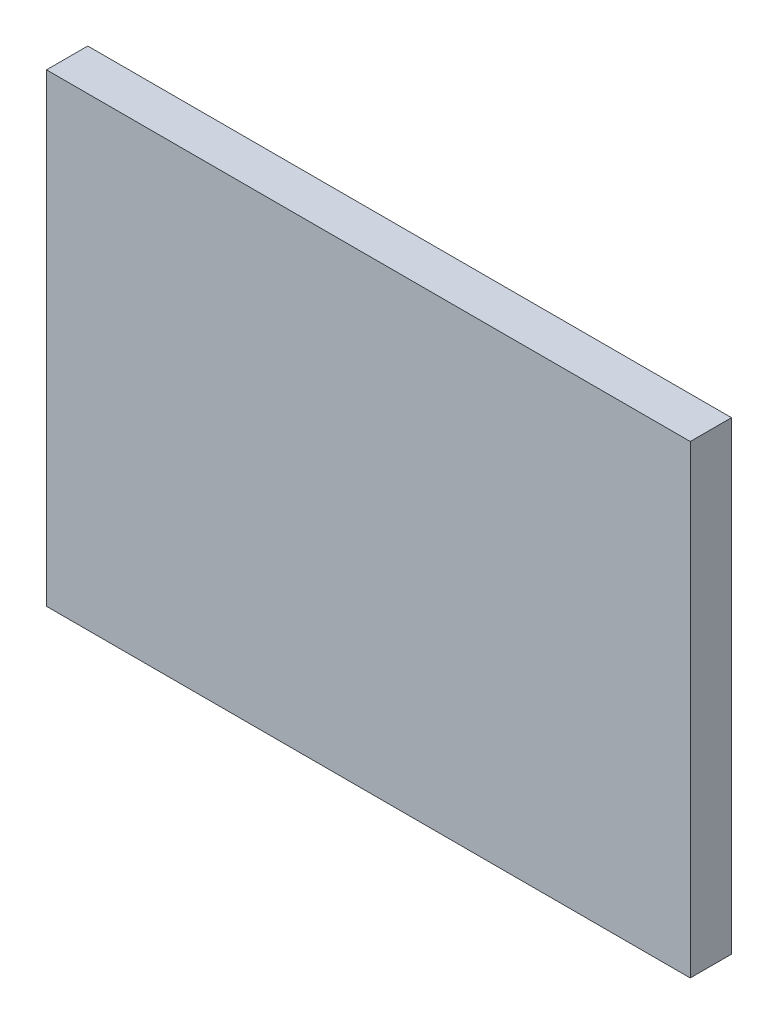
ISO-10303-21;
HEADER;
FILE_DESCRIPTION(('STEP AP214'),'2;1');
FILE_NAME('part.step','',(''),(''),'','','');
FILE_SCHEMA(('AUTOMOTIVE_DESIGN { 1 0 10303 214 1 1 1 1 }'));
ENDSEC;
DATA;
#1=APPLICATION_CONTEXT('core data for automotive mechanical design processes');
#2=APPLICATION_PROTOCOL_DEFINITION('international standard','automotive_design',2000,#1);
#3=PRODUCT_CONTEXT('',#1,'mechanical');
#4=PRODUCT('Part','Part','',(#3));
#5=PRODUCT_RELATED_PRODUCT_CATEGORY('part','',(#4));
#6=PRODUCT_DEFINITION_FORMATION('','',#4);
#7=PRODUCT_DEFINITION_CONTEXT('part definition',#1,'design');
#8=PRODUCT_DEFINITION('design','',#6,#7);
#9=PRODUCT_DEFINITION_SHAPE('','',#8);
#10=(LENGTH_UNIT() NAMED_UNIT(*) SI_UNIT(.MILLI.,.METRE.));
#11=(NAMED_UNIT(*) PLANE_ANGLE_UNIT() SI_UNIT($,.RADIAN.));
#12=(NAMED_UNIT(*) SI_UNIT($,.STERADIAN.) SOLID_ANGLE_UNIT());
#13=UNCERTAINTY_MEASURE_WITH_UNIT(LENGTH_MEASURE(1.E-05),#10,'distance_accuracy_value','');
#14=(GEOMETRIC_REPRESENTATION_CONTEXT(3) GLOBAL_UNCERTAINTY_ASSIGNED_CONTEXT((#13)) GLOBAL_UNIT_ASSIGNED_CONTEXT((#10,
#11,#12)) REPRESENTATION_CONTEXT('',''));
#15=CARTESIAN_POINT('',(0.,0.,0.));
#16=DIRECTION('',(0.,0.,1.));
#17=DIRECTION('',(1.,0.,0.));
#18=AXIS2_PLACEMENT_3D('',#15,#16,#17);
#19=CARTESIAN_POINT('',(29.65,21.4,3.8));
#20=DIRECTION('',(-1.,0.,0.));
#21=DIRECTION('',(0.,-1.,0.));
#22=AXIS2_PLACEMENT_3D('',#19,#20,#21);
#23=PLANE('',#22);
#24=DIRECTION('',(0.,1.,0.));
#25=VECTOR('',#24,1.);
#26=CARTESIAN_POINT('',(29.65,21.4,0.));
#27=LINE('',#26,#25);
#28=CARTESIAN_POINT('',(29.65,-21.4,0.));
#29=VERTEX_POINT('',#28);
#30=CARTESIAN_POINT('',(29.65,21.4,0.));
#31=VERTEX_POINT('',#30);
#32=EDGE_CURVE('E96',#29,#31,#27,.T.);
#33=ORIENTED_EDGE('',*,*,#32,.T.);
#34=DIRECTION('',(0.,0.,-1.));
#35=VECTOR('',#34,1.);
#36=CARTESIAN_POINT('',(29.65,21.4,3.8));
#37=LINE('',#36,#35);
#38=CARTESIAN_POINT('',(29.65,21.4,3.8));
#39=VERTEX_POINT('',#38);
#40=EDGE_CURVE('E11',#39,#31,#37,.T.);
#41=ORIENTED_EDGE('',*,*,#40,.F.);
#42=DIRECTION('',(0.,1.,0.));
#43=VECTOR('',#42,1.);
#44=CARTESIAN_POINT('',(29.65,21.4,3.8));
#45=LINE('',#44,#43);
#46=CARTESIAN_POINT('',(29.65,-21.4,3.8));
#47=VERTEX_POINT('',#46);
#48=EDGE_CURVE('E84',#47,#39,#45,.T.);
#49=ORIENTED_EDGE('',*,*,#48,.F.);
#50=DIRECTION('',(0.,0.,-1.));
#51=VECTOR('',#50,1.);
#52=CARTESIAN_POINT('',(29.65,-21.4,3.8));
#53=LINE('',#52,#51);
#54=EDGE_CURVE('E92',#47,#29,#53,.T.);
#55=ORIENTED_EDGE('',*,*,#54,.T.);
#56=EDGE_LOOP('',(#33,#41,#49,#55));
#57=FACE_BOUND('',#56,.T.);
#58=ADVANCED_FACE('F33',(#57),#23,.F.);
#59=CARTESIAN_POINT('',(-29.65,21.4,3.8));
#60=DIRECTION('',(0.,-1.,0.));
#61=DIRECTION('',(0.,0.,-1.));
#62=AXIS2_PLACEMENT_3D('',#59,#60,#61);
#63=PLANE('',#62);
#64=DIRECTION('',(-1.,0.,0.));
#65=VECTOR('',#64,1.);
#66=CARTESIAN_POINT('',(-29.65,21.4,0.));
#67=LINE('',#66,#65);
#68=CARTESIAN_POINT('',(-29.65,21.4,0.));
#69=VERTEX_POINT('',#68);
#70=EDGE_CURVE('E88',#31,#69,#67,.T.);
#71=ORIENTED_EDGE('',*,*,#70,.T.);
#72=DIRECTION('',(0.,0.,-1.));
#73=VECTOR('',#72,1.);
#74=CARTESIAN_POINT('',(-29.65,21.4,3.8));
#75=LINE('',#74,#73);
#76=CARTESIAN_POINT('',(-29.65,21.4,3.8));
#77=VERTEX_POINT('',#76);
#78=EDGE_CURVE('E41',#77,#69,#75,.T.);
#79=ORIENTED_EDGE('',*,*,#78,.F.);
#80=DIRECTION('',(-1.,0.,0.));
#81=VECTOR('',#80,1.);
#82=CARTESIAN_POINT('',(-29.65,21.4,3.8));
#83=LINE('',#82,#81);
#84=EDGE_CURVE('E79',#39,#77,#83,.T.);
#85=ORIENTED_EDGE('',*,*,#84,.F.);
#86=ORIENTED_EDGE('',*,*,#40,.T.);
#87=EDGE_LOOP('',(#71,#79,#85,#86));
#88=FACE_BOUND('',#87,.T.);
#89=ADVANCED_FACE('F87',(#88),#63,.F.);
#90=CARTESIAN_POINT('',(-29.65,21.4,3.8));
#91=DIRECTION('',(1.,0.,0.));
#92=DIRECTION('',(0.,1.,0.));
#93=AXIS2_PLACEMENT_3D('',#90,#91,#92);
#94=PLANE('',#93);
#95=DIRECTION('',(0.,-1.,0.));
#96=VECTOR('',#95,1.);
#97=CARTESIAN_POINT('',(-29.65,21.4,0.));
#98=LINE('',#97,#96);
#99=CARTESIAN_POINT('',(-29.65,-21.4,0.));
#100=VERTEX_POINT('',#99);
#101=EDGE_CURVE('E66',#69,#100,#98,.T.);
#102=ORIENTED_EDGE('',*,*,#101,.T.);
#103=DIRECTION('',(0.,0.,-1.));
#104=VECTOR('',#103,1.);
#105=CARTESIAN_POINT('',(-29.65,-21.4,3.8));
#106=LINE('',#105,#104);
#107=CARTESIAN_POINT('',(-29.65,-21.4,3.8));
#108=VERTEX_POINT('',#107);
#109=EDGE_CURVE('E89',#108,#100,#106,.T.);
#110=ORIENTED_EDGE('',*,*,#109,.F.);
#111=DIRECTION('',(0.,-1.,0.));
#112=VECTOR('',#111,1.);
#113=CARTESIAN_POINT('',(-29.65,21.4,3.8));
#114=LINE('',#113,#112);
#115=EDGE_CURVE('E82',#77,#108,#114,.T.);
#116=ORIENTED_EDGE('',*,*,#115,.F.);
#117=ORIENTED_EDGE('',*,*,#78,.T.);
#118=EDGE_LOOP('',(#102,#110,#116,#117));
#119=FACE_BOUND('',#118,.T.);
#120=ADVANCED_FACE('F90',(#119),#94,.F.);
#121=CARTESIAN_POINT('',(-29.65,-21.4,3.8));
#122=DIRECTION('',(0.,1.,0.));
#123=DIRECTION('',(0.,0.,1.));
#124=AXIS2_PLACEMENT_3D('',#121,#122,#123);
#125=PLANE('',#124);
#126=DIRECTION('',(1.,0.,0.));
#127=VECTOR('',#126,1.);
#128=CARTESIAN_POINT('',(-29.65,-21.4,0.));
#129=LINE('',#128,#127);
#130=EDGE_CURVE('E72',#100,#29,#129,.T.);
#131=ORIENTED_EDGE('',*,*,#130,.T.);
#132=ORIENTED_EDGE('',*,*,#54,.F.);
#133=DIRECTION('',(1.,0.,0.));
#134=VECTOR('',#133,1.);
#135=CARTESIAN_POINT('',(-29.65,-21.4,3.8));
#136=LINE('',#135,#134);
#137=EDGE_CURVE('E49',#108,#47,#136,.T.);
#138=ORIENTED_EDGE('',*,*,#137,.F.);
#139=ORIENTED_EDGE('',*,*,#109,.T.);
#140=EDGE_LOOP('',(#131,#132,#138,#139));
#141=FACE_BOUND('',#140,.T.);
#142=ADVANCED_FACE('F103',(#141),#125,.F.);
#143=CARTESIAN_POINT('',(0.,0.,3.8));
#144=DIRECTION('',(0.,0.,1.));
#145=DIRECTION('',(1.,0.,0.));
#146=AXIS2_PLACEMENT_3D('',#143,#144,#145);
#147=PLANE('',#146);
#148=ORIENTED_EDGE('',*,*,#48,.T.);
#149=ORIENTED_EDGE('',*,*,#84,.T.);
#150=ORIENTED_EDGE('',*,*,#115,.T.);
#151=ORIENTED_EDGE('',*,*,#137,.T.);
#152=EDGE_LOOP('',(#148,#149,#150,#151));
#153=FACE_BOUND('',#152,.T.);
#154=ADVANCED_FACE('F80',(#153),#147,.T.);
#155=CARTESIAN_POINT('',(0.,0.,0.));
#156=DIRECTION('',(0.,0.,1.));
#157=DIRECTION('',(1.,0.,0.));
#158=AXIS2_PLACEMENT_3D('',#155,#156,#157);
#159=PLANE('',#158);
#160=ORIENTED_EDGE('',*,*,#32,.F.);
#161=ORIENTED_EDGE('',*,*,#130,.F.);
#162=ORIENTED_EDGE('',*,*,#101,.F.);
#163=ORIENTED_EDGE('',*,*,#70,.F.);
#164=EDGE_LOOP('',(#160,#161,#162,#163));
#165=FACE_BOUND('',#164,.T.);
#166=ADVANCED_FACE('F106',(#165),#159,.F.);
#167=CLOSED_SHELL('',(#58,#89,#120,#142,#154,#166));
#168=MANIFOLD_SOLID_BREP('B2',#167);
#169=ADVANCED_BREP_SHAPE_REPRESENTATION('',(#18,#168),#14);
#170=SHAPE_DEFINITION_REPRESENTATION(#9,#169);
ENDSEC;
END-ISO-10303-21;
